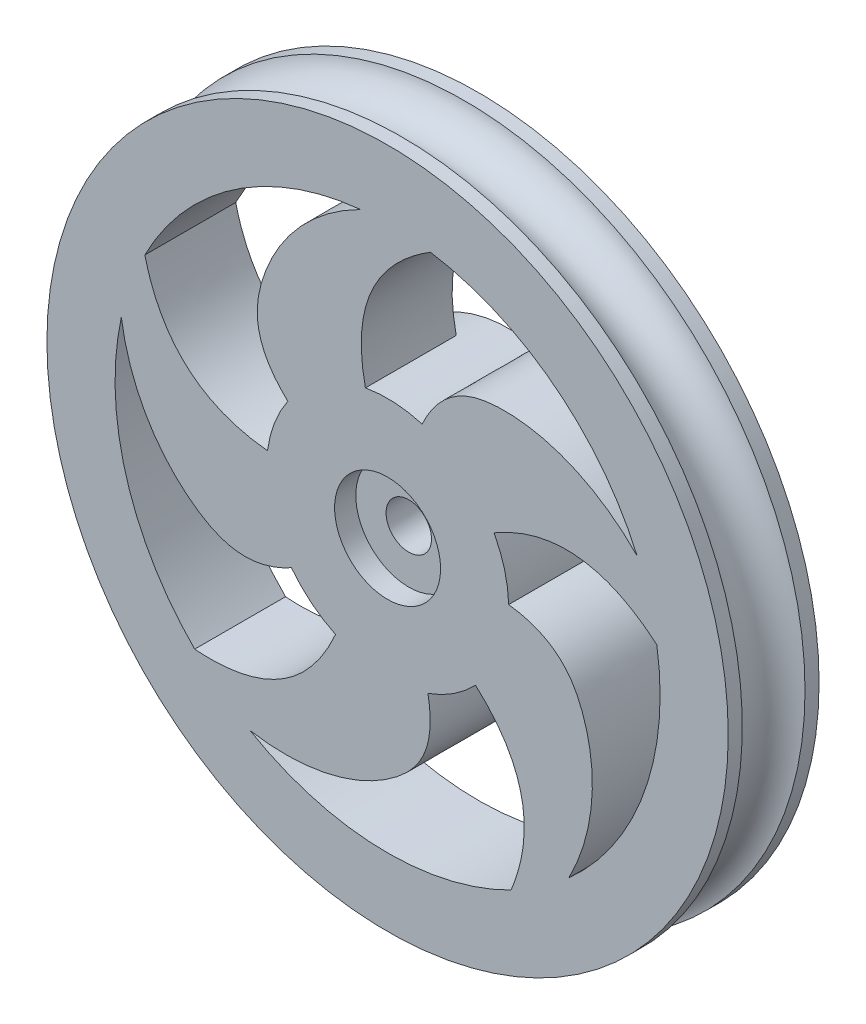
ISO-10303-21;
HEADER;
FILE_DESCRIPTION(('STEP AP214'),'2;1');
FILE_NAME('part.step','',(''),(''),'','','');
FILE_SCHEMA(('AUTOMOTIVE_DESIGN { 1 0 10303 214 1 1 1 1 }'));
ENDSEC;
DATA;
#1=APPLICATION_CONTEXT('core data for automotive mechanical design processes');
#2=APPLICATION_PROTOCOL_DEFINITION('international standard','automotive_design',2000,#1);
#3=PRODUCT_CONTEXT('',#1,'mechanical');
#4=PRODUCT('Part','Part','',(#3));
#5=PRODUCT_RELATED_PRODUCT_CATEGORY('part','',(#4));
#6=PRODUCT_DEFINITION_FORMATION('','',#4);
#7=PRODUCT_DEFINITION_CONTEXT('part definition',#1,'design');
#8=PRODUCT_DEFINITION('design','',#6,#7);
#9=PRODUCT_DEFINITION_SHAPE('','',#8);
#10=(LENGTH_UNIT() NAMED_UNIT(*) SI_UNIT(.MILLI.,.METRE.));
#11=(NAMED_UNIT(*) PLANE_ANGLE_UNIT() SI_UNIT($,.RADIAN.));
#12=(NAMED_UNIT(*) SI_UNIT($,.STERADIAN.) SOLID_ANGLE_UNIT());
#13=UNCERTAINTY_MEASURE_WITH_UNIT(LENGTH_MEASURE(1.E-05),#10,'distance_accuracy_value','');
#14=(GEOMETRIC_REPRESENTATION_CONTEXT(3) GLOBAL_UNCERTAINTY_ASSIGNED_CONTEXT((#13)) GLOBAL_UNIT_ASSIGNED_CONTEXT((#10,
#11,#12)) REPRESENTATION_CONTEXT('',''));
#15=CARTESIAN_POINT('',(0.,0.,0.));
#16=DIRECTION('',(0.,0.,1.));
#17=DIRECTION('',(1.,0.,0.));
#18=AXIS2_PLACEMENT_3D('',#15,#16,#17);
#19=CARTESIAN_POINT('',(0.,0.,-2.54));
#20=DIRECTION('',(0.,0.,1.));
#21=DIRECTION('',(1.,0.,0.));
#22=AXIS2_PLACEMENT_3D('',#19,#20,#21);
#23=CYLINDRICAL_SURFACE('',#22,1.905);
#24=CARTESIAN_POINT('',(0.,0.,2.54));
#25=DIRECTION('',(0.,0.,-1.));
#26=DIRECTION('',(-1.,0.,0.));
#27=AXIS2_PLACEMENT_3D('',#24,#25,#26);
#28=CIRCLE('',#27,1.905);
#29=CARTESIAN_POINT('',(-1.905,0.,2.54));
#30=VERTEX_POINT('',#29);
#31=EDGE_CURVE('E471',#30,#30,#28,.T.);
#32=ORIENTED_EDGE('',*,*,#31,.T.);
#33=EDGE_LOOP('',(#32));
#34=FACE_BOUND('',#33,.T.);
#35=CARTESIAN_POINT('',(0.,0.,5.842));
#36=DIRECTION('',(0.,0.,1.));
#37=DIRECTION('',(1.,0.,0.));
#38=AXIS2_PLACEMENT_3D('',#35,#36,#37);
#39=CIRCLE('',#38,1.905);
#40=CARTESIAN_POINT('',(1.905,0.,5.842));
#41=VERTEX_POINT('',#40);
#42=EDGE_CURVE('E37',#41,#41,#39,.F.);
#43=ORIENTED_EDGE('',*,*,#42,.F.);
#44=EDGE_LOOP('',(#43));
#45=FACE_BOUND('',#44,.T.);
#46=ADVANCED_FACE('F33',(#34,#45),#23,.F.);
#47=CARTESIAN_POINT('',(0.,0.,7.62));
#48=DIRECTION('',(0.,0.,1.));
#49=DIRECTION('',(1.,0.,0.));
#50=AXIS2_PLACEMENT_3D('',#47,#48,#49);
#51=PLANE('',#50);
#52=CARTESIAN_POINT('',(0.,0.,7.62));
#53=DIRECTION('',(0.,0.,1.));
#54=DIRECTION('',(1.,0.,0.));
#55=AXIS2_PLACEMENT_3D('',#52,#53,#54);
#56=CIRCLE('',#55,4.445);
#57=CARTESIAN_POINT('',(4.445,0.,7.62));
#58=VERTEX_POINT('',#57);
#59=EDGE_CURVE('E234',#58,#58,#56,.T.);
#60=ORIENTED_EDGE('',*,*,#59,.F.);
#61=EDGE_LOOP('',(#60));
#62=FACE_BOUND('',#61,.T.);
#63=CARTESIAN_POINT('',(15.2013566205811,-17.0733229599254,7.62));
#64=CARTESIAN_POINT('',(17.340771533893,-12.9694160344226,7.62));
#65=CARTESIAN_POINT('',(17.9192392588937,-5.64812963712148,7.62));
#66=CARTESIAN_POINT('',(14.1823236781896,-0.243954457198566,7.62));
#67=CARTESIAN_POINT('',(10.1567610808318,0.256523579618754,7.62));
#68=B_SPLINE_CURVE_WITH_KNOTS('',3,(#63,#64,#65,#66,#67),.UNSPECIFIED.,.F.,.F.,(4,1,4),(0.,
0.59372692615426,1.),.UNSPECIFIED.);
#69=CARTESIAN_POINT('',(15.2013566205811,-17.0733229599254,7.62));
#70=VERTEX_POINT('',#69);
#71=CARTESIAN_POINT('',(10.1567610808318,0.256523579618402,7.62));
#72=VERTEX_POINT('',#71);
#73=EDGE_CURVE('E293',#70,#72,#68,.T.);
#74=ORIENTED_EDGE('',*,*,#73,.T.);
#75=CARTESIAN_POINT('',(0.,0.,7.62));
#76=DIRECTION('',(0.,0.,1.));
#77=DIRECTION('',(-1.,0.,0.));
#78=AXIS2_PLACEMENT_3D('',#75,#76,#77);
#79=CIRCLE('',#78,10.16);
#80=CARTESIAN_POINT('',(8.92460603357686,4.85561604180598,7.62));
#81=VERTEX_POINT('',#80);
#82=EDGE_CURVE('E267',#72,#81,#79,.T.);
#83=ORIENTED_EDGE('',*,*,#82,.T.);
#84=CARTESIAN_POINT('',(8.92460603357686,4.85561604180598,7.62));
#85=CARTESIAN_POINT('',(16.1148744409484,9.05157325449814,7.62));
#86=CARTESIAN_POINT('',(22.5820141245615,3.55418599374075,7.62));
#87=B_SPLINE_CURVE_WITH_KNOTS('',2,(#84,#85,#86),.UNSPECIFIED.,.F.,.F.,(3,3),(0.,1.),.UNSPECIFIED.);
#88=CARTESIAN_POINT('',(22.5820141245615,3.55418599374075,7.62));
#89=VERTEX_POINT('',#88);
#90=EDGE_CURVE('E259',#81,#89,#87,.T.);
#91=ORIENTED_EDGE('',*,*,#90,.T.);
#92=CARTESIAN_POINT('',(0.,0.,7.62));
#93=DIRECTION('',(0.,0.,-1.));
#94=DIRECTION('',(-1.,0.,0.));
#95=AXIS2_PLACEMENT_3D('',#92,#93,#94);
#96=CIRCLE('',#95,22.86);
#97=EDGE_CURVE('E266',#89,#70,#96,.T.);
#98=ORIENTED_EDGE('',*,*,#97,.T.);
#99=EDGE_LOOP('',(#74,#83,#91,#98));
#100=FACE_BOUND('',#99,.T.);
#101=CARTESIAN_POINT('',(-22.3336032870758,4.87747518861117,7.62));
#102=CARTESIAN_POINT('',(-21.6522103423729,0.299828207967121,7.62));
#103=CARTESIAN_POINT('',(-17.8168563904513,-5.96323170581202,7.62));
#104=CARTESIAN_POINT('',(-11.6171337075542,-8.13879739955164,7.62));
#105=CARTESIAN_POINT('',(-8.06621154523262,-6.1775263097421,7.62));
#106=B_SPLINE_CURVE_WITH_KNOTS('',3,(#101,#102,#103,#104,#105),.UNSPECIFIED.,.F.,.F.,(4,1,4),
(0.,0.59372692615426,1.),.UNSPECIFIED.);
#107=CARTESIAN_POINT('',(-22.3336032870758,4.87747518861117,7.62));
#108=VERTEX_POINT('',#107);
#109=CARTESIAN_POINT('',(-8.06621154523262,-6.17752630974211,7.62));
#110=VERTEX_POINT('',#109);
#111=EDGE_CURVE('E370',#108,#110,#106,.T.);
#112=ORIENTED_EDGE('',*,*,#111,.T.);
#113=CARTESIAN_POINT('',(0.,0.,7.62));
#114=DIRECTION('',(0.,0.,1.));
#115=DIRECTION('',(-1.,0.,0.));
#116=AXIS2_PLACEMENT_3D('',#113,#114,#115);
#117=CIRCLE('',#116,10.16);
#118=CARTESIAN_POINT('',(-4.3660984490948,-9.17402770503839,7.62));
#119=VERTEX_POINT('',#118);
#120=EDGE_CURVE('E344',#110,#119,#117,.T.);
#121=ORIENTED_EDGE('',*,*,#120,.T.);
#122=CARTESIAN_POINT('',(-4.3660984490948,-9.17402770503839,7.62));
#123=CARTESIAN_POINT('',(-7.71682601590704,-16.7949621276497,7.62));
#124=CARTESIAN_POINT('',(-16.180135082957,-16.1487717395864,7.62));
#125=B_SPLINE_CURVE_WITH_KNOTS('',2,(#122,#123,#124),.UNSPECIFIED.,.F.,.F.,(3,3),(0.,1.),.UNSPECIFIED.);
#126=CARTESIAN_POINT('',(-16.180135082957,-16.1487717395864,7.62));
#127=VERTEX_POINT('',#126);
#128=EDGE_CURVE('E336',#119,#127,#125,.T.);
#129=ORIENTED_EDGE('',*,*,#128,.T.);
#130=CARTESIAN_POINT('',(0.,0.,7.62));
#131=DIRECTION('',(0.,0.,-1.));
#132=DIRECTION('',(-1.,0.,0.));
#133=AXIS2_PLACEMENT_3D('',#130,#131,#132);
#134=CIRCLE('',#133,22.86);
#135=EDGE_CURVE('E343',#127,#108,#134,.T.);
#136=ORIENTED_EDGE('',*,*,#135,.T.);
#137=EDGE_LOOP('',(#112,#121,#129,#136));
#138=FACE_BOUND('',#137,.T.);
#139=CARTESIAN_POINT('',(0.,0.,7.62));
#140=DIRECTION('',(0.,0.,1.));
#141=DIRECTION('',(1.,0.,0.));
#142=AXIS2_PLACEMENT_3D('',#139,#140,#141);
#143=CIRCLE('',#142,28.575);
#144=CARTESIAN_POINT('',(28.575,0.,7.62));
#145=VERTEX_POINT('',#144);
#146=EDGE_CURVE('E459',#145,#145,#143,.T.);
#147=ORIENTED_EDGE('',*,*,#146,.T.);
#148=EDGE_LOOP('',(#147));
#149=FACE_BOUND('',#148,.T.);
#150=CARTESIAN_POINT('',(-2.2627084001402,22.7477416614471,7.62));
#151=CARTESIAN_POINT('',(-6.40574739062018,20.6851277499617,7.62));
#152=CARTESIAN_POINT('',(-11.1770817829767,15.1020974315423,7.62));
#153=CARTESIAN_POINT('',(-11.3303480432103,8.53352400300547,7.62));
#154=CARTESIAN_POINT('',(-8.36777309916582,5.76246243899921,7.62));
#155=B_SPLINE_CURVE_WITH_KNOTS('',3,(#150,#151,#152,#153,#154),.UNSPECIFIED.,.F.,.F.,(4,1,4),
(0.,0.59372692615426,1.),.UNSPECIFIED.);
#156=CARTESIAN_POINT('',(-2.2627084001402,22.7477416614471,7.62));
#157=VERTEX_POINT('',#156);
#158=CARTESIAN_POINT('',(-8.36777309916582,5.76246243899922,7.62));
#159=VERTEX_POINT('',#158);
#160=EDGE_CURVE('E381',#157,#159,#155,.T.);
#161=ORIENTED_EDGE('',*,*,#160,.T.);
#162=CARTESIAN_POINT('',(0.,0.,7.62));
#163=DIRECTION('',(0.,0.,1.));
#164=DIRECTION('',(-1.,0.,0.));
#165=AXIS2_PLACEMENT_3D('',#162,#163,#164);
#166=CIRCLE('',#165,10.16);
#167=CARTESIAN_POINT('',(-10.0742174494336,1.31747591307335,7.62));
#168=VERTEX_POINT('',#167);
#169=EDGE_CURVE('E387',#159,#168,#166,.T.);
#170=ORIENTED_EDGE('',*,*,#169,.T.);
#171=CARTESIAN_POINT('',(-10.0742174494336,1.31747591307335,7.62));
#172=CARTESIAN_POINT('',(-18.35758855398,2.14920895021765,7.62));
#173=CARTESIAN_POINT('',(-20.3583313050137,10.3979779993661,7.62));
#174=B_SPLINE_CURVE_WITH_KNOTS('',2,(#171,#172,#173),.UNSPECIFIED.,.F.,.F.,(3,3),(0.,1.),.UNSPECIFIED.);
#175=CARTESIAN_POINT('',(-20.3583313050137,10.3979779993661,7.62));
#176=VERTEX_POINT('',#175);
#177=EDGE_CURVE('E556',#168,#176,#174,.T.);
#178=ORIENTED_EDGE('',*,*,#177,.T.);
#179=CARTESIAN_POINT('',(0.,0.,7.62));
#180=DIRECTION('',(0.,0.,-1.));
#181=DIRECTION('',(-1.,0.,0.));
#182=AXIS2_PLACEMENT_3D('',#179,#180,#181);
#183=CIRCLE('',#182,22.86);
#184=EDGE_CURVE('E491',#176,#157,#183,.T.);
#185=ORIENTED_EDGE('',*,*,#184,.T.);
#186=EDGE_LOOP('',(#161,#170,#178,#185));
#187=FACE_BOUND('',#186,.T.);
#188=CARTESIAN_POINT('',(-11.5402175225331,-19.7332962156002,7.62));
#189=CARTESIAN_POINT('',(-6.97605453253234,-20.4998237266511,7.62));
#190=CARTESIAN_POINT('',(0.165658961003877,-18.7875773085256,7.62));
#191=CARTESIAN_POINT('',(4.15056456008909,-13.5635774234774,7.62));
#192=CARTESIAN_POINT('',(3.38258020376378,-9.58038366481767,7.62));
#193=B_SPLINE_CURVE_WITH_KNOTS('',3,(#188,#189,#190,#191,#192),.UNSPECIFIED.,.F.,.F.,(4,1,4),
(0.,0.59372692615426,1.),.UNSPECIFIED.);
#194=CARTESIAN_POINT('',(-11.5402175225331,-19.7332962156002,7.62));
#195=VERTEX_POINT('',#194);
#196=CARTESIAN_POINT('',(3.38258020376378,-9.58038366481767,7.62));
#197=VERTEX_POINT('',#196);
#198=EDGE_CURVE('E304',#195,#197,#193,.T.);
#199=ORIENTED_EDGE('',*,*,#198,.T.);
#200=CARTESIAN_POINT('',(0.,0.,7.62));
#201=DIRECTION('',(0.,0.,1.));
#202=DIRECTION('',(-1.,0.,0.));
#203=AXIS2_PLACEMENT_3D('',#200,#201,#202);
#204=CIRCLE('',#203,10.16);
#205=CARTESIAN_POINT('',(7.37582020966397,-6.98733684852195,7.62));
#206=VERTEX_POINT('',#205);
#207=EDGE_CURVE('E310',#197,#206,#204,.T.);
#208=ORIENTED_EDGE('',*,*,#207,.T.);
#209=CARTESIAN_POINT('',(7.37582020966397,-6.98733684852194,7.62));
#210=CARTESIAN_POINT('',(13.5883277908832,-12.5290663848721,7.62));
#211=CARTESIAN_POINT('',(10.3584578811787,-20.3784678109972,7.62));
#212=B_SPLINE_CURVE_WITH_KNOTS('',2,(#209,#210,#211),.UNSPECIFIED.,.F.,.F.,(3,3),(0.,1.),.UNSPECIFIED.);
#213=CARTESIAN_POINT('',(10.3584578811787,-20.3784678109971,7.62));
#214=VERTEX_POINT('',#213);
#215=EDGE_CURVE('E602',#206,#214,#212,.T.);
#216=ORIENTED_EDGE('',*,*,#215,.T.);
#217=CARTESIAN_POINT('',(0.,0.,7.62));
#218=DIRECTION('',(0.,0.,-1.));
#219=DIRECTION('',(-1.,0.,0.));
#220=AXIS2_PLACEMENT_3D('',#217,#218,#219);
#221=CIRCLE('',#220,22.86);
#222=EDGE_CURVE('E592',#214,#195,#221,.T.);
#223=ORIENTED_EDGE('',*,*,#222,.T.);
#224=EDGE_LOOP('',(#199,#208,#216,#223));
#225=FACE_BOUND('',#224,.T.);
#226=CARTESIAN_POINT('',(20.9351725891632,9.18140232545923,7.62));
#227=CARTESIAN_POINT('',(17.6932407316276,12.4842838031369,7.62));
#228=CARTESIAN_POINT('',(10.9090399535327,15.2968412199203,7.62));
#229=CARTESIAN_POINT('',(4.6145935124848,13.412805277221,7.62));
#230=CARTESIAN_POINT('',(2.89464335980425,9.7389239559379,7.62));
#231=B_SPLINE_CURVE_WITH_KNOTS('',3,(#226,#227,#228,#229,#230),.UNSPECIFIED.,.F.,.F.,(4,1,4),
(0.,0.59372692615426,1.),.UNSPECIFIED.);
#232=CARTESIAN_POINT('',(20.9351725891632,9.18140232545924,7.62));
#233=VERTEX_POINT('',#232);
#234=CARTESIAN_POINT('',(2.89464335980425,9.73892395593791,7.62));
#235=VERTEX_POINT('',#234);
#236=EDGE_CURVE('E211',#233,#235,#231,.T.);
#237=ORIENTED_EDGE('',*,*,#236,.T.);
#238=CARTESIAN_POINT('',(0.,0.,7.62));
#239=DIRECTION('',(0.,0.,1.));
#240=DIRECTION('',(-1.,0.,0.));
#241=AXIS2_PLACEMENT_3D('',#238,#239,#240);
#242=CIRCLE('',#241,10.16);
#243=CARTESIAN_POINT('',(-1.86011034470945,9.98827259867816,7.62));
#244=VERTEX_POINT('',#243);
#245=EDGE_CURVE('E219',#235,#244,#242,.T.);
#246=ORIENTED_EDGE('',*,*,#245,.T.);
#247=CARTESIAN_POINT('',(-1.86011034470945,9.98827259867815,7.62));
#248=CARTESIAN_POINT('',(-3.62878766194298,18.1232463078131,7.62));
#249=CARTESIAN_POINT('',(3.59799438223468,22.5750755574684,7.62));
#250=B_SPLINE_CURVE_WITH_KNOTS('',2,(#247,#248,#249),.UNSPECIFIED.,.F.,.F.,(3,3),(0.,1.),.UNSPECIFIED.);
#251=CARTESIAN_POINT('',(3.59799438223468,22.5750755574684,7.62));
#252=VERTEX_POINT('',#251);
#253=EDGE_CURVE('E51',#244,#252,#250,.T.);
#254=ORIENTED_EDGE('',*,*,#253,.T.);
#255=CARTESIAN_POINT('',(0.,0.,7.62));
#256=DIRECTION('',(0.,0.,-1.));
#257=DIRECTION('',(-1.,0.,0.));
#258=AXIS2_PLACEMENT_3D('',#255,#256,#257);
#259=CIRCLE('',#258,22.86);
#260=EDGE_CURVE('E216',#252,#233,#259,.T.);
#261=ORIENTED_EDGE('',*,*,#260,.T.);
#262=EDGE_LOOP('',(#237,#246,#254,#261));
#263=FACE_BOUND('',#262,.T.);
#264=ADVANCED_FACE('F223',(#62,#100,#138,#149,#187,#225,#263),#51,.T.);
#265=CARTESIAN_POINT('',(0.,0.,7.62));
#266=DIRECTION('',(0.,0.,-1.));
#267=DIRECTION('',(-1.,0.,0.));
#268=AXIS2_PLACEMENT_3D('',#265,#266,#267);
#269=CYLINDRICAL_SURFACE('',#268,28.575);
#270=CARTESIAN_POINT('',(0.,0.,1.17912166244054));
#271=DIRECTION('',(0.,0.,1.));
#272=DIRECTION('',(1.,0.,0.));
#273=AXIS2_PLACEMENT_3D('',#270,#271,#272);
#274=CIRCLE('',#273,28.575);
#275=CARTESIAN_POINT('',(28.575,0.,1.17912166244054));
#276=VERTEX_POINT('',#275);
#277=EDGE_CURVE('E460',#276,#276,#274,.F.);
#278=ORIENTED_EDGE('',*,*,#277,.T.);
#279=EDGE_LOOP('',(#278));
#280=FACE_BOUND('',#279,.T.);
#281=CARTESIAN_POINT('',(0.,0.,0.));
#282=DIRECTION('',(0.,0.,1.));
#283=DIRECTION('',(1.,0.,0.));
#284=AXIS2_PLACEMENT_3D('',#281,#282,#283);
#285=CIRCLE('',#284,28.575);
#286=CARTESIAN_POINT('',(28.575,0.,0.));
#287=VERTEX_POINT('',#286);
#288=EDGE_CURVE('E457',#287,#287,#285,.T.);
#289=ORIENTED_EDGE('',*,*,#288,.T.);
#290=EDGE_LOOP('',(#289));
#291=FACE_BOUND('',#290,.T.);
#292=ADVANCED_FACE('F445',(#280,#291),#269,.T.);
#293=CARTESIAN_POINT('',(0.,0.,0.));
#294=DIRECTION('',(0.,0.,1.));
#295=DIRECTION('',(1.,0.,0.));
#296=AXIS2_PLACEMENT_3D('',#293,#294,#295);
#297=PLANE('',#296);
#298=CARTESIAN_POINT('',(0.,0.,0.));
#299=DIRECTION('',(0.,0.,1.));
#300=DIRECTION('',(1.,0.,0.));
#301=AXIS2_PLACEMENT_3D('',#298,#299,#300);
#302=CIRCLE('',#301,10.16);
#303=CARTESIAN_POINT('',(2.89464335980425,9.7389239559379,0.));
#304=VERTEX_POINT('',#303);
#305=CARTESIAN_POINT('',(8.92460603357686,4.85561604180598,0.));
#306=VERTEX_POINT('',#305);
#307=EDGE_CURVE('E42',#304,#306,#302,.F.);
#308=ORIENTED_EDGE('',*,*,#307,.F.);
#309=CARTESIAN_POINT('',(20.9351725891632,9.18140232545923,0.));
#310=CARTESIAN_POINT('',(17.6932407316276,12.4842838031369,0.));
#311=CARTESIAN_POINT('',(10.9090399535327,15.2968412199203,0.));
#312=CARTESIAN_POINT('',(4.6145935124848,13.412805277221,0.));
#313=CARTESIAN_POINT('',(2.89464335980425,9.7389239559379,0.));
#314=B_SPLINE_CURVE_WITH_KNOTS('',3,(#309,#310,#311,#312,#313),.UNSPECIFIED.,.F.,.F.,(4,1,4),
(0.,0.59372692615426,1.),.UNSPECIFIED.);
#315=CARTESIAN_POINT('',(20.9351725891632,9.18140232545924,0.));
#316=VERTEX_POINT('',#315);
#317=EDGE_CURVE('E59',#316,#304,#314,.T.);
#318=ORIENTED_EDGE('',*,*,#317,.F.);
#319=CARTESIAN_POINT('',(0.,0.,0.));
#320=DIRECTION('',(0.,0.,-1.));
#321=DIRECTION('',(-1.,0.,0.));
#322=AXIS2_PLACEMENT_3D('',#319,#320,#321);
#323=CIRCLE('',#322,22.86);
#324=CARTESIAN_POINT('',(3.59799438223468,22.5750755574684,0.));
#325=VERTEX_POINT('',#324);
#326=EDGE_CURVE('E225',#325,#316,#323,.T.);
#327=ORIENTED_EDGE('',*,*,#326,.F.);
#328=CARTESIAN_POINT('',(-1.86011034470945,9.98827259867815,0.));
#329=CARTESIAN_POINT('',(-3.62878766194298,18.1232463078131,0.));
#330=CARTESIAN_POINT('',(3.59799438223468,22.5750755574684,0.));
#331=B_SPLINE_CURVE_WITH_KNOTS('',2,(#328,#329,#330),.UNSPECIFIED.,.F.,.F.,(3,3),(0.,1.),.UNSPECIFIED.);
#332=CARTESIAN_POINT('',(-1.86011034470945,9.98827259867815,0.));
#333=VERTEX_POINT('',#332);
#334=EDGE_CURVE('E228',#333,#325,#331,.T.);
#335=ORIENTED_EDGE('',*,*,#334,.F.);
#336=CARTESIAN_POINT('',(-8.36777309916582,5.76246243899922,0.));
#337=VERTEX_POINT('',#336);
#338=EDGE_CURVE('E11',#337,#333,#302,.F.);
#339=ORIENTED_EDGE('',*,*,#338,.F.);
#340=CARTESIAN_POINT('',(-2.2627084001402,22.7477416614471,0.));
#341=CARTESIAN_POINT('',(-6.40574739062018,20.6851277499617,0.));
#342=CARTESIAN_POINT('',(-11.1770817829767,15.1020974315423,0.));
#343=CARTESIAN_POINT('',(-11.3303480432103,8.53352400300547,0.));
#344=CARTESIAN_POINT('',(-8.36777309916582,5.76246243899921,0.));
#345=B_SPLINE_CURVE_WITH_KNOTS('',3,(#340,#341,#342,#343,#344),.UNSPECIFIED.,.F.,.F.,(4,1,4),
(0.,0.59372692615426,1.),.UNSPECIFIED.);
#346=CARTESIAN_POINT('',(-2.2627084001402,22.7477416614471,0.));
#347=VERTEX_POINT('',#346);
#348=EDGE_CURVE('E373',#347,#337,#345,.T.);
#349=ORIENTED_EDGE('',*,*,#348,.F.);
#350=CARTESIAN_POINT('',(0.,0.,0.));
#351=DIRECTION('',(0.,0.,-1.));
#352=DIRECTION('',(-1.,0.,0.));
#353=AXIS2_PLACEMENT_3D('',#350,#351,#352);
#354=CIRCLE('',#353,22.86);
#355=CARTESIAN_POINT('',(-20.3583313050137,10.3979779993661,0.));
#356=VERTEX_POINT('',#355);
#357=EDGE_CURVE('E388',#356,#347,#354,.T.);
#358=ORIENTED_EDGE('',*,*,#357,.F.);
#359=CARTESIAN_POINT('',(-10.0742174494336,1.31747591307335,0.));
#360=CARTESIAN_POINT('',(-18.35758855398,2.14920895021765,0.));
#361=CARTESIAN_POINT('',(-20.3583313050137,10.3979779993661,0.));
#362=B_SPLINE_CURVE_WITH_KNOTS('',2,(#359,#360,#361),.UNSPECIFIED.,.F.,.F.,(3,3),(0.,1.),.UNSPECIFIED.);
#363=CARTESIAN_POINT('',(-10.0742174494336,1.31747591307335,0.));
#364=VERTEX_POINT('',#363);
#365=EDGE_CURVE('E567',#364,#356,#362,.T.);
#366=ORIENTED_EDGE('',*,*,#365,.F.);
#367=CARTESIAN_POINT('',(-8.06621154523262,-6.17752630974211,0.));
#368=VERTEX_POINT('',#367);
#369=EDGE_CURVE('E44',#368,#364,#302,.F.);
#370=ORIENTED_EDGE('',*,*,#369,.F.);
#371=CARTESIAN_POINT('',(-22.3336032870758,4.87747518861117,0.));
#372=CARTESIAN_POINT('',(-21.6522103423729,0.299828207967121,0.));
#373=CARTESIAN_POINT('',(-17.8168563904513,-5.96323170581202,0.));
#374=CARTESIAN_POINT('',(-11.6171337075542,-8.13879739955164,0.));
#375=CARTESIAN_POINT('',(-8.06621154523262,-6.1775263097421,0.));
#376=B_SPLINE_CURVE_WITH_KNOTS('',3,(#371,#372,#373,#374,#375),.UNSPECIFIED.,.F.,.F.,(4,1,4),
(0.,0.59372692615426,1.),.UNSPECIFIED.);
#377=CARTESIAN_POINT('',(-22.3336032870758,4.87747518861117,0.));
#378=VERTEX_POINT('',#377);
#379=EDGE_CURVE('E351',#378,#368,#376,.T.);
#380=ORIENTED_EDGE('',*,*,#379,.F.);
#381=CARTESIAN_POINT('',(0.,0.,0.));
#382=DIRECTION('',(0.,0.,-1.));
#383=DIRECTION('',(-1.,0.,0.));
#384=AXIS2_PLACEMENT_3D('',#381,#382,#383);
#385=CIRCLE('',#384,22.86);
#386=CARTESIAN_POINT('',(-16.180135082957,-16.1487717395864,0.));
#387=VERTEX_POINT('',#386);
#388=EDGE_CURVE('E364',#387,#378,#385,.T.);
#389=ORIENTED_EDGE('',*,*,#388,.F.);
#390=CARTESIAN_POINT('',(-4.3660984490948,-9.17402770503839,0.));
#391=CARTESIAN_POINT('',(-7.71682601590704,-16.7949621276497,0.));
#392=CARTESIAN_POINT('',(-16.180135082957,-16.1487717395864,0.));
#393=B_SPLINE_CURVE_WITH_KNOTS('',2,(#390,#391,#392),.UNSPECIFIED.,.F.,.F.,(3,3),(0.,1.),.UNSPECIFIED.);
#394=CARTESIAN_POINT('',(-4.3660984490948,-9.17402770503839,0.));
#395=VERTEX_POINT('',#394);
#396=EDGE_CURVE('E355',#395,#387,#393,.T.);
#397=ORIENTED_EDGE('',*,*,#396,.F.);
#398=CARTESIAN_POINT('',(3.38258020376378,-9.58038366481768,0.));
#399=VERTEX_POINT('',#398);
#400=EDGE_CURVE('E643',#399,#395,#302,.F.);
#401=ORIENTED_EDGE('',*,*,#400,.F.);
#402=CARTESIAN_POINT('',(-11.5402175225331,-19.7332962156002,0.));
#403=CARTESIAN_POINT('',(-6.97605453253234,-20.4998237266511,0.));
#404=CARTESIAN_POINT('',(0.165658961003877,-18.7875773085256,0.));
#405=CARTESIAN_POINT('',(4.15056456008909,-13.5635774234774,0.));
#406=CARTESIAN_POINT('',(3.38258020376378,-9.58038366481767,0.));
#407=B_SPLINE_CURVE_WITH_KNOTS('',3,(#402,#403,#404,#405,#406),.UNSPECIFIED.,.F.,.F.,(4,1,4),
(0.,0.59372692615426,1.),.UNSPECIFIED.);
#408=CARTESIAN_POINT('',(-11.5402175225331,-19.7332962156002,0.));
#409=VERTEX_POINT('',#408);
#410=EDGE_CURVE('E296',#409,#399,#407,.T.);
#411=ORIENTED_EDGE('',*,*,#410,.F.);
#412=CARTESIAN_POINT('',(0.,0.,0.));
#413=DIRECTION('',(0.,0.,-1.));
#414=DIRECTION('',(-1.,0.,0.));
#415=AXIS2_PLACEMENT_3D('',#412,#413,#414);
#416=CIRCLE('',#415,22.86);
#417=CARTESIAN_POINT('',(10.3584578811787,-20.3784678109971,0.));
#418=VERTEX_POINT('',#417);
#419=EDGE_CURVE('E311',#418,#409,#416,.T.);
#420=ORIENTED_EDGE('',*,*,#419,.F.);
#421=CARTESIAN_POINT('',(7.37582020966397,-6.98733684852194,0.));
#422=CARTESIAN_POINT('',(13.5883277908832,-12.5290663848721,0.));
#423=CARTESIAN_POINT('',(10.3584578811787,-20.3784678109972,0.));
#424=B_SPLINE_CURVE_WITH_KNOTS('',2,(#421,#422,#423),.UNSPECIFIED.,.F.,.F.,(3,3),(0.,1.),.UNSPECIFIED.);
#425=CARTESIAN_POINT('',(7.37582020966397,-6.98733684852194,0.));
#426=VERTEX_POINT('',#425);
#427=EDGE_CURVE('E614',#426,#418,#424,.T.);
#428=ORIENTED_EDGE('',*,*,#427,.F.);
#429=CARTESIAN_POINT('',(10.1567610808318,0.256523579618754,0.));
#430=VERTEX_POINT('',#429);
#431=EDGE_CURVE('E859',#430,#426,#302,.F.);
#432=ORIENTED_EDGE('',*,*,#431,.F.);
#433=CARTESIAN_POINT('',(15.2013566205811,-17.0733229599254,0.));
#434=CARTESIAN_POINT('',(17.340771533893,-12.9694160344226,0.));
#435=CARTESIAN_POINT('',(17.9192392588937,-5.64812963712148,0.));
#436=CARTESIAN_POINT('',(14.1823236781896,-0.243954457198566,0.));
#437=CARTESIAN_POINT('',(10.1567610808318,0.256523579618754,0.));
#438=B_SPLINE_CURVE_WITH_KNOTS('',3,(#433,#434,#435,#436,#437),.UNSPECIFIED.,.F.,.F.,(4,1,4),
(0.,0.59372692615426,1.),.UNSPECIFIED.);
#439=CARTESIAN_POINT('',(15.2013566205811,-17.0733229599254,0.));
#440=VERTEX_POINT('',#439);
#441=EDGE_CURVE('E274',#440,#430,#438,.T.);
#442=ORIENTED_EDGE('',*,*,#441,.F.);
#443=CARTESIAN_POINT('',(0.,0.,0.));
#444=DIRECTION('',(0.,0.,-1.));
#445=DIRECTION('',(-1.,0.,0.));
#446=AXIS2_PLACEMENT_3D('',#443,#444,#445);
#447=CIRCLE('',#446,22.86);
#448=CARTESIAN_POINT('',(22.5820141245615,3.55418599374075,0.));
#449=VERTEX_POINT('',#448);
#450=EDGE_CURVE('E287',#449,#440,#447,.T.);
#451=ORIENTED_EDGE('',*,*,#450,.F.);
#452=CARTESIAN_POINT('',(8.92460603357686,4.85561604180598,0.));
#453=CARTESIAN_POINT('',(16.1148744409484,9.05157325449814,0.));
#454=CARTESIAN_POINT('',(22.5820141245615,3.55418599374075,0.));
#455=B_SPLINE_CURVE_WITH_KNOTS('',2,(#452,#453,#454),.UNSPECIFIED.,.F.,.F.,(3,3),(0.,1.),.UNSPECIFIED.);
#456=EDGE_CURVE('E278',#306,#449,#455,.T.);
#457=ORIENTED_EDGE('',*,*,#456,.F.);
#458=EDGE_LOOP('',(#308,#318,#327,#335,#339,#349,#358,#366,#370,#380,#389,#397,#401,#411,#420,
#428,#432,#442,#451,#457));
#459=FACE_BOUND('',#458,.T.);
#460=ORIENTED_EDGE('',*,*,#288,.F.);
#461=EDGE_LOOP('',(#460));
#462=FACE_BOUND('',#461,.T.);
#463=ADVANCED_FACE('F442',(#459,#462),#297,.F.);
#464=CARTESIAN_POINT('',(0.,0.,3.81));
#465=DIRECTION('',(0.,0.,-1.));
#466=DIRECTION('',(-1.,0.,0.));
#467=AXIS2_PLACEMENT_3D('',#464,#465,#466);
#468=TOROIDAL_SURFACE('',#467,29.0124564812189,2.667);
#469=CARTESIAN_POINT('',(0.,0.,6.44087833755946));
#470=DIRECTION('',(0.,0.,-1.));
#471=DIRECTION('',(-1.,0.,0.));
#472=AXIS2_PLACEMENT_3D('',#469,#470,#471);
#473=CIRCLE('',#472,28.575);
#474=CARTESIAN_POINT('',(-28.575,0.,6.44087833755946));
#475=VERTEX_POINT('',#474);
#476=EDGE_CURVE('E465',#475,#475,#473,.F.);
#477=ORIENTED_EDGE('',*,*,#476,.F.);
#478=EDGE_LOOP('',(#477));
#479=FACE_BOUND('',#478,.T.);
#480=ORIENTED_EDGE('',*,*,#277,.F.);
#481=EDGE_LOOP('',(#480));
#482=FACE_BOUND('',#481,.T.);
#483=ADVANCED_FACE('F439',(#479,#482),#468,.F.);
#484=ORIENTED_EDGE('',*,*,#476,.T.);
#485=EDGE_LOOP('',(#484));
#486=FACE_BOUND('',#485,.T.);
#487=ORIENTED_EDGE('',*,*,#146,.F.);
#488=EDGE_LOOP('',(#487));
#489=FACE_BOUND('',#488,.T.);
#490=ADVANCED_FACE('F35',(#486,#489),#269,.T.);
#491=CARTESIAN_POINT('',(0.,0.,-2.54));
#492=DIRECTION('',(0.,0.,1.));
#493=DIRECTION('',(1.,0.,0.));
#494=AXIS2_PLACEMENT_3D('',#491,#492,#493);
#495=CYLINDRICAL_SURFACE('',#494,10.16);
#496=CARTESIAN_POINT('',(0.,0.,-2.54));
#497=DIRECTION('',(0.,0.,-1.));
#498=DIRECTION('',(-1.,0.,0.));
#499=AXIS2_PLACEMENT_3D('',#496,#497,#498);
#500=CIRCLE('',#499,10.16);
#501=CARTESIAN_POINT('',(-10.16,0.,-2.54));
#502=VERTEX_POINT('',#501);
#503=EDGE_CURVE('E470',#502,#502,#500,.T.);
#504=ORIENTED_EDGE('',*,*,#503,.F.);
#505=EDGE_LOOP('',(#504));
#506=FACE_BOUND('',#505,.T.);
#507=ORIENTED_EDGE('',*,*,#338,.T.);
#508=DIRECTION('',(0.,0.,-1.));
#509=VECTOR('',#508,1.);
#510=CARTESIAN_POINT('',(-1.86011034470945,9.98827259867815,7.62));
#511=LINE('',#510,#509);
#512=EDGE_CURVE('E215',#244,#333,#511,.T.);
#513=ORIENTED_EDGE('',*,*,#512,.F.);
#514=ORIENTED_EDGE('',*,*,#245,.F.);
#515=DIRECTION('',(0.,0.,-1.));
#516=VECTOR('',#515,1.);
#517=CARTESIAN_POINT('',(2.89464335980425,9.73892395593791,7.62));
#518=LINE('',#517,#516);
#519=EDGE_CURVE('E207',#235,#304,#518,.T.);
#520=ORIENTED_EDGE('',*,*,#519,.T.);
#521=ORIENTED_EDGE('',*,*,#307,.T.);
#522=DIRECTION('',(0.,0.,-1.));
#523=VECTOR('',#522,1.);
#524=CARTESIAN_POINT('',(8.92460603357686,4.85561604180598,7.62));
#525=LINE('',#524,#523);
#526=EDGE_CURVE('E299',#81,#306,#525,.T.);
#527=ORIENTED_EDGE('',*,*,#526,.F.);
#528=ORIENTED_EDGE('',*,*,#82,.F.);
#529=DIRECTION('',(0.,0.,-1.));
#530=VECTOR('',#529,1.);
#531=CARTESIAN_POINT('',(10.1567610808318,0.256523579618402,7.62));
#532=LINE('',#531,#530);
#533=EDGE_CURVE('E273',#72,#430,#532,.T.);
#534=ORIENTED_EDGE('',*,*,#533,.T.);
#535=ORIENTED_EDGE('',*,*,#431,.T.);
#536=DIRECTION('',(0.,0.,-1.));
#537=VECTOR('',#536,1.);
#538=CARTESIAN_POINT('',(7.37582020966397,-6.98733684852194,7.62));
#539=LINE('',#538,#537);
#540=EDGE_CURVE('E598',#206,#426,#539,.T.);
#541=ORIENTED_EDGE('',*,*,#540,.F.);
#542=ORIENTED_EDGE('',*,*,#207,.F.);
#543=DIRECTION('',(0.,0.,-1.));
#544=VECTOR('',#543,1.);
#545=CARTESIAN_POINT('',(3.38258020376378,-9.58038366481767,7.62));
#546=LINE('',#545,#544);
#547=EDGE_CURVE('E595',#197,#399,#546,.T.);
#548=ORIENTED_EDGE('',*,*,#547,.T.);
#549=ORIENTED_EDGE('',*,*,#400,.T.);
#550=DIRECTION('',(0.,0.,-1.));
#551=VECTOR('',#550,1.);
#552=CARTESIAN_POINT('',(-4.3660984490948,-9.17402770503839,7.62));
#553=LINE('',#552,#551);
#554=EDGE_CURVE('E376',#119,#395,#553,.T.);
#555=ORIENTED_EDGE('',*,*,#554,.F.);
#556=ORIENTED_EDGE('',*,*,#120,.F.);
#557=DIRECTION('',(0.,0.,-1.));
#558=VECTOR('',#557,1.);
#559=CARTESIAN_POINT('',(-8.06621154523262,-6.17752630974211,7.62));
#560=LINE('',#559,#558);
#561=EDGE_CURVE('E350',#110,#368,#560,.T.);
#562=ORIENTED_EDGE('',*,*,#561,.T.);
#563=ORIENTED_EDGE('',*,*,#369,.T.);
#564=DIRECTION('',(0.,0.,-1.));
#565=VECTOR('',#564,1.);
#566=CARTESIAN_POINT('',(-10.0742174494336,1.31747591307335,7.62));
#567=LINE('',#566,#565);
#568=EDGE_CURVE('E482',#168,#364,#567,.T.);
#569=ORIENTED_EDGE('',*,*,#568,.F.);
#570=ORIENTED_EDGE('',*,*,#169,.F.);
#571=DIRECTION('',(0.,0.,-1.));
#572=VECTOR('',#571,1.);
#573=CARTESIAN_POINT('',(-8.36777309916582,5.76246243899922,7.62));
#574=LINE('',#573,#572);
#575=EDGE_CURVE('E489',#159,#337,#574,.T.);
#576=ORIENTED_EDGE('',*,*,#575,.T.);
#577=EDGE_LOOP('',(#507,#513,#514,#520,#521,#527,#528,#534,#535,#541,#542,#548,#549,#555,#556,
#562,#563,#569,#570,#576));
#578=FACE_BOUND('',#577,.T.);
#579=ADVANCED_FACE('F220',(#506,#578),#495,.T.);
#580=CARTESIAN_POINT('',(0.,0.,-2.54));
#581=DIRECTION('',(0.,0.,-1.));
#582=DIRECTION('',(-1.,0.,0.));
#583=AXIS2_PLACEMENT_3D('',#580,#581,#582);
#584=PLANE('',#583);
#585=DIRECTION('',(-0.12236839902586,0.992484747953261,0.));
#586=VECTOR('',#585,1.);
#587=CARTESIAN_POINT('',(-6.08780045219284,-4.5922877727353,-2.54));
#588=LINE('',#587,#586);
#589=CARTESIAN_POINT('',(-6.08780045219284,-4.5922877727353,-2.54));
#590=VERTEX_POINT('',#589);
#591=CARTESIAN_POINT('',(-7.02093809877385,2.97604595840174,-2.54));
#592=VERTEX_POINT('',#591);
#593=EDGE_CURVE('E473',#590,#592,#588,.T.);
#594=ORIENTED_EDGE('',*,*,#593,.F.);
#595=DIRECTION('',(-0.920701204109049,0.390268231799805,0.));
#596=VECTOR('',#595,1.);
#597=CARTESIAN_POINT('',(0.933137646581013,-7.56833373113704,-2.54));
#598=LINE('',#597,#596);
#599=CARTESIAN_POINT('',(0.933137646581013,-7.56833373113704,-2.54));
#600=VERTEX_POINT('',#599);
#601=EDGE_CURVE('E504',#600,#590,#598,.T.);
#602=ORIENTED_EDGE('',*,*,#601,.F.);
#603=DIRECTION('',(-0.798332805083189,-0.602216516153456,0.));
#604=VECTOR('',#603,1.);
#605=CARTESIAN_POINT('',(7.02093809877384,-2.97604595840174,-2.54));
#606=LINE('',#605,#604);
#607=CARTESIAN_POINT('',(7.02093809877384,-2.97604595840174,-2.54));
#608=VERTEX_POINT('',#607);
#609=EDGE_CURVE('E501',#608,#600,#606,.T.);
#610=ORIENTED_EDGE('',*,*,#609,.F.);
#611=DIRECTION('',(0.12236839902586,-0.992484747953261,0.));
#612=VECTOR('',#611,1.);
#613=CARTESIAN_POINT('',(6.08780045219284,4.5922877727353,-2.54));
#614=LINE('',#613,#612);
#615=CARTESIAN_POINT('',(6.08780045219284,4.5922877727353,-2.54));
#616=VERTEX_POINT('',#615);
#617=EDGE_CURVE('E498',#616,#608,#614,.T.);
#618=ORIENTED_EDGE('',*,*,#617,.F.);
#619=DIRECTION('',(0.92070120410905,-0.390268231799805,0.));
#620=VECTOR('',#619,1.);
#621=CARTESIAN_POINT('',(-0.933137646581013,7.56833373113704,-2.54));
#622=LINE('',#621,#620);
#623=CARTESIAN_POINT('',(-0.933137646581013,7.56833373113704,-2.54));
#624=VERTEX_POINT('',#623);
#625=EDGE_CURVE('E495',#624,#616,#622,.T.);
#626=ORIENTED_EDGE('',*,*,#625,.F.);
#627=DIRECTION('',(0.798332805083189,0.602216516153457,0.));
#628=VECTOR('',#627,1.);
#629=CARTESIAN_POINT('',(-7.02093809877385,2.97604595840174,-2.54));
#630=LINE('',#629,#628);
#631=EDGE_CURVE('E476',#592,#624,#630,.T.);
#632=ORIENTED_EDGE('',*,*,#631,.F.);
#633=EDGE_LOOP('',(#594,#602,#610,#618,#626,#632));
#634=FACE_BOUND('',#633,.T.);
#635=ORIENTED_EDGE('',*,*,#503,.T.);
#636=EDGE_LOOP('',(#635));
#637=FACE_BOUND('',#636,.T.);
#638=ADVANCED_FACE('F431',(#634,#637),#584,.T.);
#639=CARTESIAN_POINT('',(-6.08780045219284,-4.5922877727353,2.54));
#640=DIRECTION('',(-0.992484747953261,-0.12236839902586,0.));
#641=DIRECTION('',(0.12236839902586,-0.992484747953261,0.));
#642=AXIS2_PLACEMENT_3D('',#639,#640,#641);
#643=PLANE('',#642);
#644=DIRECTION('',(0.,0.,-1.));
#645=VECTOR('',#644,1.);
#646=CARTESIAN_POINT('',(-7.02093809877385,2.97604595840174,2.54));
#647=LINE('',#646,#645);
#648=CARTESIAN_POINT('',(-7.02093809877385,2.97604595840174,2.54));
#649=VERTEX_POINT('',#648);
#650=EDGE_CURVE('E525',#649,#592,#647,.T.);
#651=ORIENTED_EDGE('',*,*,#650,.F.);
#652=DIRECTION('',(-0.12236839902586,0.992484747953261,0.));
#653=VECTOR('',#652,1.);
#654=CARTESIAN_POINT('',(-6.08780045219284,-4.5922877727353,2.54));
#655=LINE('',#654,#653);
#656=CARTESIAN_POINT('',(-6.08780045219284,-4.5922877727353,2.54));
#657=VERTEX_POINT('',#656);
#658=EDGE_CURVE('E507',#657,#649,#655,.T.);
#659=ORIENTED_EDGE('',*,*,#658,.F.);
#660=DIRECTION('',(0.,0.,-1.));
#661=VECTOR('',#660,1.);
#662=CARTESIAN_POINT('',(-6.08780045219284,-4.5922877727353,2.54));
#663=LINE('',#662,#661);
#664=EDGE_CURVE('E526',#657,#590,#663,.T.);
#665=ORIENTED_EDGE('',*,*,#664,.T.);
#666=ORIENTED_EDGE('',*,*,#593,.T.);
#667=EDGE_LOOP('',(#651,#659,#665,#666));
#668=FACE_BOUND('',#667,.T.);
#669=ADVANCED_FACE('F413',(#668),#643,.F.);
#670=CARTESIAN_POINT('',(0.933137646581013,-7.56833373113704,2.54));
#671=DIRECTION('',(-0.390268231799805,-0.920701204109049,0.));
#672=DIRECTION('',(0.92070120410905,-0.390268231799805,0.));
#673=AXIS2_PLACEMENT_3D('',#670,#671,#672);
#674=PLANE('',#673);
#675=ORIENTED_EDGE('',*,*,#664,.F.);
#676=DIRECTION('',(-0.920701204109049,0.390268231799805,0.));
#677=VECTOR('',#676,1.);
#678=CARTESIAN_POINT('',(0.933137646581013,-7.56833373113704,2.54));
#679=LINE('',#678,#677);
#680=CARTESIAN_POINT('',(0.933137646581013,-7.56833373113704,2.54));
#681=VERTEX_POINT('',#680);
#682=EDGE_CURVE('E522',#681,#657,#679,.T.);
#683=ORIENTED_EDGE('',*,*,#682,.F.);
#684=DIRECTION('',(0.,0.,-1.));
#685=VECTOR('',#684,1.);
#686=CARTESIAN_POINT('',(0.933137646581013,-7.56833373113704,2.54));
#687=LINE('',#686,#685);
#688=EDGE_CURVE('E528',#681,#600,#687,.T.);
#689=ORIENTED_EDGE('',*,*,#688,.T.);
#690=ORIENTED_EDGE('',*,*,#601,.T.);
#691=EDGE_LOOP('',(#675,#683,#689,#690));
#692=FACE_BOUND('',#691,.T.);
#693=ADVANCED_FACE('F409',(#692),#674,.F.);
#694=CARTESIAN_POINT('',(7.02093809877384,-2.97604595840174,2.54));
#695=DIRECTION('',(0.602216516153456,-0.79833280508319,0.));
#696=DIRECTION('',(0.79833280508319,0.602216516153456,0.));
#697=AXIS2_PLACEMENT_3D('',#694,#695,#696);
#698=PLANE('',#697);
#699=ORIENTED_EDGE('',*,*,#688,.F.);
#700=DIRECTION('',(-0.798332805083189,-0.602216516153456,0.));
#701=VECTOR('',#700,1.);
#702=CARTESIAN_POINT('',(7.02093809877384,-2.97604595840174,2.54));
#703=LINE('',#702,#701);
#704=CARTESIAN_POINT('',(7.02093809877384,-2.97604595840174,2.54));
#705=VERTEX_POINT('',#704);
#706=EDGE_CURVE('E519',#705,#681,#703,.T.);
#707=ORIENTED_EDGE('',*,*,#706,.F.);
#708=DIRECTION('',(0.,0.,-1.));
#709=VECTOR('',#708,1.);
#710=CARTESIAN_POINT('',(7.02093809877384,-2.97604595840174,2.54));
#711=LINE('',#710,#709);
#712=EDGE_CURVE('E530',#705,#608,#711,.T.);
#713=ORIENTED_EDGE('',*,*,#712,.T.);
#714=ORIENTED_EDGE('',*,*,#609,.T.);
#715=EDGE_LOOP('',(#699,#707,#713,#714));
#716=FACE_BOUND('',#715,.T.);
#717=ADVANCED_FACE('F412',(#716),#698,.F.);
#718=CARTESIAN_POINT('',(6.08780045219284,4.5922877727353,2.54));
#719=DIRECTION('',(0.992484747953261,0.12236839902586,0.));
#720=DIRECTION('',(-0.12236839902586,0.992484747953261,0.));
#721=AXIS2_PLACEMENT_3D('',#718,#719,#720);
#722=PLANE('',#721);
#723=ORIENTED_EDGE('',*,*,#712,.F.);
#724=DIRECTION('',(0.12236839902586,-0.992484747953261,0.));
#725=VECTOR('',#724,1.);
#726=CARTESIAN_POINT('',(6.08780045219284,4.5922877727353,2.54));
#727=LINE('',#726,#725);
#728=CARTESIAN_POINT('',(6.08780045219284,4.5922877727353,2.54));
#729=VERTEX_POINT('',#728);
#730=EDGE_CURVE('E516',#729,#705,#727,.T.);
#731=ORIENTED_EDGE('',*,*,#730,.F.);
#732=DIRECTION('',(0.,0.,-1.));
#733=VECTOR('',#732,1.);
#734=CARTESIAN_POINT('',(6.08780045219284,4.5922877727353,2.54));
#735=LINE('',#734,#733);
#736=EDGE_CURVE('E532',#729,#616,#735,.T.);
#737=ORIENTED_EDGE('',*,*,#736,.T.);
#738=ORIENTED_EDGE('',*,*,#617,.T.);
#739=EDGE_LOOP('',(#723,#731,#737,#738));
#740=FACE_BOUND('',#739,.T.);
#741=ADVANCED_FACE('F417',(#740),#722,.F.);
#742=CARTESIAN_POINT('',(-0.933137646581013,7.56833373113704,2.54));
#743=DIRECTION('',(0.390268231799805,0.92070120410905,0.));
#744=DIRECTION('',(-0.92070120410905,0.390268231799805,0.));
#745=AXIS2_PLACEMENT_3D('',#742,#743,#744);
#746=PLANE('',#745);
#747=ORIENTED_EDGE('',*,*,#736,.F.);
#748=DIRECTION('',(0.92070120410905,-0.390268231799805,0.));
#749=VECTOR('',#748,1.);
#750=CARTESIAN_POINT('',(-0.933137646581013,7.56833373113704,2.54));
#751=LINE('',#750,#749);
#752=CARTESIAN_POINT('',(-0.933137646581013,7.56833373113704,2.54));
#753=VERTEX_POINT('',#752);
#754=EDGE_CURVE('E513',#753,#729,#751,.T.);
#755=ORIENTED_EDGE('',*,*,#754,.F.);
#756=DIRECTION('',(0.,0.,-1.));
#757=VECTOR('',#756,1.);
#758=CARTESIAN_POINT('',(-0.933137646581013,7.56833373113704,2.54));
#759=LINE('',#758,#757);
#760=EDGE_CURVE('E534',#753,#624,#759,.T.);
#761=ORIENTED_EDGE('',*,*,#760,.T.);
#762=ORIENTED_EDGE('',*,*,#625,.T.);
#763=EDGE_LOOP('',(#747,#755,#761,#762));
#764=FACE_BOUND('',#763,.T.);
#765=ADVANCED_FACE('F421',(#764),#746,.F.);
#766=CARTESIAN_POINT('',(-7.02093809877385,2.97604595840174,2.54));
#767=DIRECTION('',(-0.602216516153457,0.798332805083189,0.));
#768=DIRECTION('',(-0.798332805083189,-0.602216516153457,0.));
#769=AXIS2_PLACEMENT_3D('',#766,#767,#768);
#770=PLANE('',#769);
#771=ORIENTED_EDGE('',*,*,#760,.F.);
#772=DIRECTION('',(0.798332805083189,0.602216516153457,0.));
#773=VECTOR('',#772,1.);
#774=CARTESIAN_POINT('',(-7.02093809877385,2.97604595840174,2.54));
#775=LINE('',#774,#773);
#776=EDGE_CURVE('E510',#649,#753,#775,.T.);
#777=ORIENTED_EDGE('',*,*,#776,.F.);
#778=ORIENTED_EDGE('',*,*,#650,.T.);
#779=ORIENTED_EDGE('',*,*,#631,.T.);
#780=EDGE_LOOP('',(#771,#777,#778,#779));
#781=FACE_BOUND('',#780,.T.);
#782=ADVANCED_FACE('F407',(#781),#770,.F.);
#783=CARTESIAN_POINT('',(0.,0.,2.54));
#784=DIRECTION('',(0.,0.,-1.));
#785=DIRECTION('',(-1.,0.,0.));
#786=AXIS2_PLACEMENT_3D('',#783,#784,#785);
#787=PLANE('',#786);
#788=ORIENTED_EDGE('',*,*,#31,.F.);
#789=EDGE_LOOP('',(#788));
#790=FACE_BOUND('',#789,.T.);
#791=ORIENTED_EDGE('',*,*,#658,.T.);
#792=ORIENTED_EDGE('',*,*,#776,.T.);
#793=ORIENTED_EDGE('',*,*,#754,.T.);
#794=ORIENTED_EDGE('',*,*,#730,.T.);
#795=ORIENTED_EDGE('',*,*,#706,.T.);
#796=ORIENTED_EDGE('',*,*,#682,.T.);
#797=EDGE_LOOP('',(#791,#792,#793,#794,#795,#796));
#798=FACE_BOUND('',#797,.T.);
#799=ADVANCED_FACE('F399',(#790,#798),#787,.T.);
#800=DIRECTION('',(0.,0.,-1.));
#801=VECTOR('',#800,1.);
#802=SURFACE_OF_LINEAR_EXTRUSION('',#155,#801);
#803=ORIENTED_EDGE('',*,*,#348,.T.);
#804=ORIENTED_EDGE('',*,*,#575,.F.);
#805=ORIENTED_EDGE('',*,*,#160,.F.);
#806=DIRECTION('',(0.,0.,-1.));
#807=VECTOR('',#806,1.);
#808=CARTESIAN_POINT('',(-2.2627084001402,22.7477416614471,7.62));
#809=LINE('',#808,#807);
#810=EDGE_CURVE('E474',#157,#347,#809,.T.);
#811=ORIENTED_EDGE('',*,*,#810,.T.);
#812=EDGE_LOOP('',(#803,#804,#805,#811));
#813=FACE_BOUND('',#812,.T.);
#814=ADVANCED_FACE('F394',(#813),#802,.F.);
#815=CARTESIAN_POINT('',(0.,0.,7.62));
#816=DIRECTION('',(0.,0.,-1.));
#817=DIRECTION('',(-1.,0.,0.));
#818=AXIS2_PLACEMENT_3D('',#815,#816,#817);
#819=CYLINDRICAL_SURFACE('',#818,22.86);
#820=ORIENTED_EDGE('',*,*,#357,.T.);
#821=ORIENTED_EDGE('',*,*,#810,.F.);
#822=ORIENTED_EDGE('',*,*,#184,.F.);
#823=DIRECTION('',(0.,0.,-1.));
#824=VECTOR('',#823,1.);
#825=CARTESIAN_POINT('',(-20.3583313050137,10.3979779993661,7.62));
#826=LINE('',#825,#824);
#827=EDGE_CURVE('E478',#176,#356,#826,.T.);
#828=ORIENTED_EDGE('',*,*,#827,.T.);
#829=EDGE_LOOP('',(#820,#821,#822,#828));
#830=FACE_BOUND('',#829,.T.);
#831=ADVANCED_FACE('F398',(#830),#819,.F.);
#832=DIRECTION('',(0.,0.,-1.));
#833=VECTOR('',#832,1.);
#834=SURFACE_OF_LINEAR_EXTRUSION('',#174,#833);
#835=ORIENTED_EDGE('',*,*,#365,.T.);
#836=ORIENTED_EDGE('',*,*,#827,.F.);
#837=ORIENTED_EDGE('',*,*,#177,.F.);
#838=ORIENTED_EDGE('',*,*,#568,.T.);
#839=EDGE_LOOP('',(#835,#836,#837,#838));
#840=FACE_BOUND('',#839,.T.);
#841=ADVANCED_FACE('F401',(#840),#834,.F.);
#842=DIRECTION('',(0.,0.,-1.));
#843=VECTOR('',#842,1.);
#844=SURFACE_OF_LINEAR_EXTRUSION('',#106,#843);
#845=ORIENTED_EDGE('',*,*,#379,.T.);
#846=ORIENTED_EDGE('',*,*,#561,.F.);
#847=ORIENTED_EDGE('',*,*,#111,.F.);
#848=DIRECTION('',(0.,0.,-1.));
#849=VECTOR('',#848,1.);
#850=CARTESIAN_POINT('',(-22.3336032870758,4.87747518861117,7.62));
#851=LINE('',#850,#849);
#852=EDGE_CURVE('E371',#108,#378,#851,.T.);
#853=ORIENTED_EDGE('',*,*,#852,.T.);
#854=EDGE_LOOP('',(#845,#846,#847,#853));
#855=FACE_BOUND('',#854,.T.);
#856=ADVANCED_FACE('F328',(#855),#844,.F.);
#857=CARTESIAN_POINT('',(0.,0.,7.62));
#858=DIRECTION('',(0.,0.,-1.));
#859=DIRECTION('',(-1.,0.,0.));
#860=AXIS2_PLACEMENT_3D('',#857,#858,#859);
#861=CYLINDRICAL_SURFACE('',#860,22.86);
#862=ORIENTED_EDGE('',*,*,#388,.T.);
#863=ORIENTED_EDGE('',*,*,#852,.F.);
#864=ORIENTED_EDGE('',*,*,#135,.F.);
#865=DIRECTION('',(0.,0.,-1.));
#866=VECTOR('',#865,1.);
#867=CARTESIAN_POINT('',(-16.180135082957,-16.1487717395864,7.62));
#868=LINE('',#867,#866);
#869=EDGE_CURVE('E374',#127,#387,#868,.T.);
#870=ORIENTED_EDGE('',*,*,#869,.T.);
#871=EDGE_LOOP('',(#862,#863,#864,#870));
#872=FACE_BOUND('',#871,.T.);
#873=ADVANCED_FACE('F325',(#872),#861,.F.);
#874=DIRECTION('',(0.,0.,-1.));
#875=VECTOR('',#874,1.);
#876=SURFACE_OF_LINEAR_EXTRUSION('',#125,#875);
#877=ORIENTED_EDGE('',*,*,#396,.T.);
#878=ORIENTED_EDGE('',*,*,#869,.F.);
#879=ORIENTED_EDGE('',*,*,#128,.F.);
#880=ORIENTED_EDGE('',*,*,#554,.T.);
#881=EDGE_LOOP('',(#877,#878,#879,#880));
#882=FACE_BOUND('',#881,.T.);
#883=ADVANCED_FACE('F322',(#882),#876,.F.);
#884=DIRECTION('',(0.,0.,-1.));
#885=VECTOR('',#884,1.);
#886=SURFACE_OF_LINEAR_EXTRUSION('',#193,#885);
#887=ORIENTED_EDGE('',*,*,#410,.T.);
#888=ORIENTED_EDGE('',*,*,#547,.F.);
#889=ORIENTED_EDGE('',*,*,#198,.F.);
#890=DIRECTION('',(0.,0.,-1.));
#891=VECTOR('',#890,1.);
#892=CARTESIAN_POINT('',(-11.5402175225331,-19.7332962156002,7.62));
#893=LINE('',#892,#891);
#894=EDGE_CURVE('E356',#195,#409,#893,.T.);
#895=ORIENTED_EDGE('',*,*,#894,.T.);
#896=EDGE_LOOP('',(#887,#888,#889,#895));
#897=FACE_BOUND('',#896,.T.);
#898=ADVANCED_FACE('F317',(#897),#886,.F.);
#899=CARTESIAN_POINT('',(0.,0.,7.62));
#900=DIRECTION('',(0.,0.,-1.));
#901=DIRECTION('',(-1.,0.,0.));
#902=AXIS2_PLACEMENT_3D('',#899,#900,#901);
#903=CYLINDRICAL_SURFACE('',#902,22.86);
#904=ORIENTED_EDGE('',*,*,#419,.T.);
#905=ORIENTED_EDGE('',*,*,#894,.F.);
#906=ORIENTED_EDGE('',*,*,#222,.F.);
#907=DIRECTION('',(0.,0.,-1.));
#908=VECTOR('',#907,1.);
#909=CARTESIAN_POINT('',(10.3584578811787,-20.3784678109971,7.62));
#910=LINE('',#909,#908);
#911=EDGE_CURVE('E627',#214,#418,#910,.T.);
#912=ORIENTED_EDGE('',*,*,#911,.T.);
#913=EDGE_LOOP('',(#904,#905,#906,#912));
#914=FACE_BOUND('',#913,.T.);
#915=ADVANCED_FACE('F321',(#914),#903,.F.);
#916=DIRECTION('',(0.,0.,-1.));
#917=VECTOR('',#916,1.);
#918=SURFACE_OF_LINEAR_EXTRUSION('',#212,#917);
#919=ORIENTED_EDGE('',*,*,#427,.T.);
#920=ORIENTED_EDGE('',*,*,#911,.F.);
#921=ORIENTED_EDGE('',*,*,#215,.F.);
#922=ORIENTED_EDGE('',*,*,#540,.T.);
#923=EDGE_LOOP('',(#919,#920,#921,#922));
#924=FACE_BOUND('',#923,.T.);
#925=ADVANCED_FACE('F324',(#924),#918,.F.);
#926=DIRECTION('',(0.,0.,-1.));
#927=VECTOR('',#926,1.);
#928=SURFACE_OF_LINEAR_EXTRUSION('',#68,#927);
#929=ORIENTED_EDGE('',*,*,#441,.T.);
#930=ORIENTED_EDGE('',*,*,#533,.F.);
#931=ORIENTED_EDGE('',*,*,#73,.F.);
#932=DIRECTION('',(0.,0.,-1.));
#933=VECTOR('',#932,1.);
#934=CARTESIAN_POINT('',(15.2013566205811,-17.0733229599254,7.62));
#935=LINE('',#934,#933);
#936=EDGE_CURVE('E294',#70,#440,#935,.T.);
#937=ORIENTED_EDGE('',*,*,#936,.T.);
#938=EDGE_LOOP('',(#929,#930,#931,#937));
#939=FACE_BOUND('',#938,.T.);
#940=ADVANCED_FACE('F251',(#939),#928,.F.);
#941=CARTESIAN_POINT('',(0.,0.,7.62));
#942=DIRECTION('',(0.,0.,-1.));
#943=DIRECTION('',(-1.,0.,0.));
#944=AXIS2_PLACEMENT_3D('',#941,#942,#943);
#945=CYLINDRICAL_SURFACE('',#944,22.86);
#946=ORIENTED_EDGE('',*,*,#450,.T.);
#947=ORIENTED_EDGE('',*,*,#936,.F.);
#948=ORIENTED_EDGE('',*,*,#97,.F.);
#949=DIRECTION('',(0.,0.,-1.));
#950=VECTOR('',#949,1.);
#951=CARTESIAN_POINT('',(22.5820141245615,3.55418599374075,7.62));
#952=LINE('',#951,#950);
#953=EDGE_CURVE('E297',#89,#449,#952,.T.);
#954=ORIENTED_EDGE('',*,*,#953,.T.);
#955=EDGE_LOOP('',(#946,#947,#948,#954));
#956=FACE_BOUND('',#955,.T.);
#957=ADVANCED_FACE('F248',(#956),#945,.F.);
#958=DIRECTION('',(0.,0.,-1.));
#959=VECTOR('',#958,1.);
#960=SURFACE_OF_LINEAR_EXTRUSION('',#87,#959);
#961=ORIENTED_EDGE('',*,*,#456,.T.);
#962=ORIENTED_EDGE('',*,*,#953,.F.);
#963=ORIENTED_EDGE('',*,*,#90,.F.);
#964=ORIENTED_EDGE('',*,*,#526,.T.);
#965=EDGE_LOOP('',(#961,#962,#963,#964));
#966=FACE_BOUND('',#965,.T.);
#967=ADVANCED_FACE('F245',(#966),#960,.F.);
#968=DIRECTION('',(0.,0.,-1.));
#969=VECTOR('',#968,1.);
#970=SURFACE_OF_LINEAR_EXTRUSION('',#231,#969);
#971=ORIENTED_EDGE('',*,*,#317,.T.);
#972=ORIENTED_EDGE('',*,*,#519,.F.);
#973=ORIENTED_EDGE('',*,*,#236,.F.);
#974=DIRECTION('',(0.,0.,-1.));
#975=VECTOR('',#974,1.);
#976=CARTESIAN_POINT('',(20.9351725891632,9.18140232545924,7.62));
#977=LINE('',#976,#975);
#978=EDGE_CURVE('E279',#233,#316,#977,.T.);
#979=ORIENTED_EDGE('',*,*,#978,.T.);
#980=EDGE_LOOP('',(#971,#972,#973,#979));
#981=FACE_BOUND('',#980,.T.);
#982=ADVANCED_FACE('F209',(#981),#970,.F.);
#983=CARTESIAN_POINT('',(0.,0.,7.62));
#984=DIRECTION('',(0.,0.,-1.));
#985=DIRECTION('',(-1.,0.,0.));
#986=AXIS2_PLACEMENT_3D('',#983,#984,#985);
#987=CYLINDRICAL_SURFACE('',#986,22.86);
#988=ORIENTED_EDGE('',*,*,#326,.T.);
#989=ORIENTED_EDGE('',*,*,#978,.F.);
#990=ORIENTED_EDGE('',*,*,#260,.F.);
#991=DIRECTION('',(0.,0.,-1.));
#992=VECTOR('',#991,1.);
#993=CARTESIAN_POINT('',(3.59799438223468,22.5750755574684,7.62));
#994=LINE('',#993,#992);
#995=EDGE_CURVE('E876',#252,#325,#994,.T.);
#996=ORIENTED_EDGE('',*,*,#995,.T.);
#997=EDGE_LOOP('',(#988,#989,#990,#996));
#998=FACE_BOUND('',#997,.T.);
#999=ADVANCED_FACE('F244',(#998),#987,.F.);
#1000=DIRECTION('',(0.,0.,-1.));
#1001=VECTOR('',#1000,1.);
#1002=SURFACE_OF_LINEAR_EXTRUSION('',#250,#1001);
#1003=ORIENTED_EDGE('',*,*,#334,.T.);
#1004=ORIENTED_EDGE('',*,*,#995,.F.);
#1005=ORIENTED_EDGE('',*,*,#253,.F.);
#1006=ORIENTED_EDGE('',*,*,#512,.T.);
#1007=EDGE_LOOP('',(#1003,#1004,#1005,#1006));
#1008=FACE_BOUND('',#1007,.T.);
#1009=ADVANCED_FACE('F246',(#1008),#1002,.F.);
#1010=CARTESIAN_POINT('',(0.,0.,5.842));
#1011=DIRECTION('',(0.,0.,1.));
#1012=DIRECTION('',(1.,0.,0.));
#1013=AXIS2_PLACEMENT_3D('',#1010,#1011,#1012);
#1014=PLANE('',#1013);
#1015=CARTESIAN_POINT('',(0.,0.,5.842));
#1016=DIRECTION('',(0.,0.,1.));
#1017=DIRECTION('',(1.,0.,0.));
#1018=AXIS2_PLACEMENT_3D('',#1015,#1016,#1017);
#1019=CIRCLE('',#1018,4.445);
#1020=CARTESIAN_POINT('',(4.445,0.,5.842));
#1021=VERTEX_POINT('',#1020);
#1022=EDGE_CURVE('E899',#1021,#1021,#1019,.T.);
#1023=ORIENTED_EDGE('',*,*,#1022,.T.);
#1024=EDGE_LOOP('',(#1023));
#1025=FACE_BOUND('',#1024,.T.);
#1026=ORIENTED_EDGE('',*,*,#42,.T.);
#1027=EDGE_LOOP('',(#1026));
#1028=FACE_BOUND('',#1027,.T.);
#1029=ADVANCED_FACE('F737',(#1025,#1028),#1014,.T.);
#1030=CARTESIAN_POINT('',(0.,0.,5.842));
#1031=DIRECTION('',(0.,0.,1.));
#1032=DIRECTION('',(1.,0.,0.));
#1033=AXIS2_PLACEMENT_3D('',#1030,#1031,#1032);
#1034=CYLINDRICAL_SURFACE('',#1033,4.445);
#1035=ORIENTED_EDGE('',*,*,#1022,.F.);
#1036=EDGE_LOOP('',(#1035));
#1037=FACE_BOUND('',#1036,.T.);
#1038=ORIENTED_EDGE('',*,*,#59,.T.);
#1039=EDGE_LOOP('',(#1038));
#1040=FACE_BOUND('',#1039,.T.);
#1041=ADVANCED_FACE('F908',(#1037,#1040),#1034,.F.);
#1042=CLOSED_SHELL('',(#46,#264,#292,#463,#483,#490,#579,#638,#669,#693,#717,#741,#765,#782,
#799,#814,#831,#841,#856,#873,#883,#898,#915,#925,#940,#957,#967,#982,#999,#1009,#1029,#1041));
#1043=MANIFOLD_SOLID_BREP('B2',#1042);
#1044=ADVANCED_BREP_SHAPE_REPRESENTATION('',(#18,#1043),#14);
#1045=SHAPE_DEFINITION_REPRESENTATION(#9,#1044);
ENDSEC;
END-ISO-10303-21;
